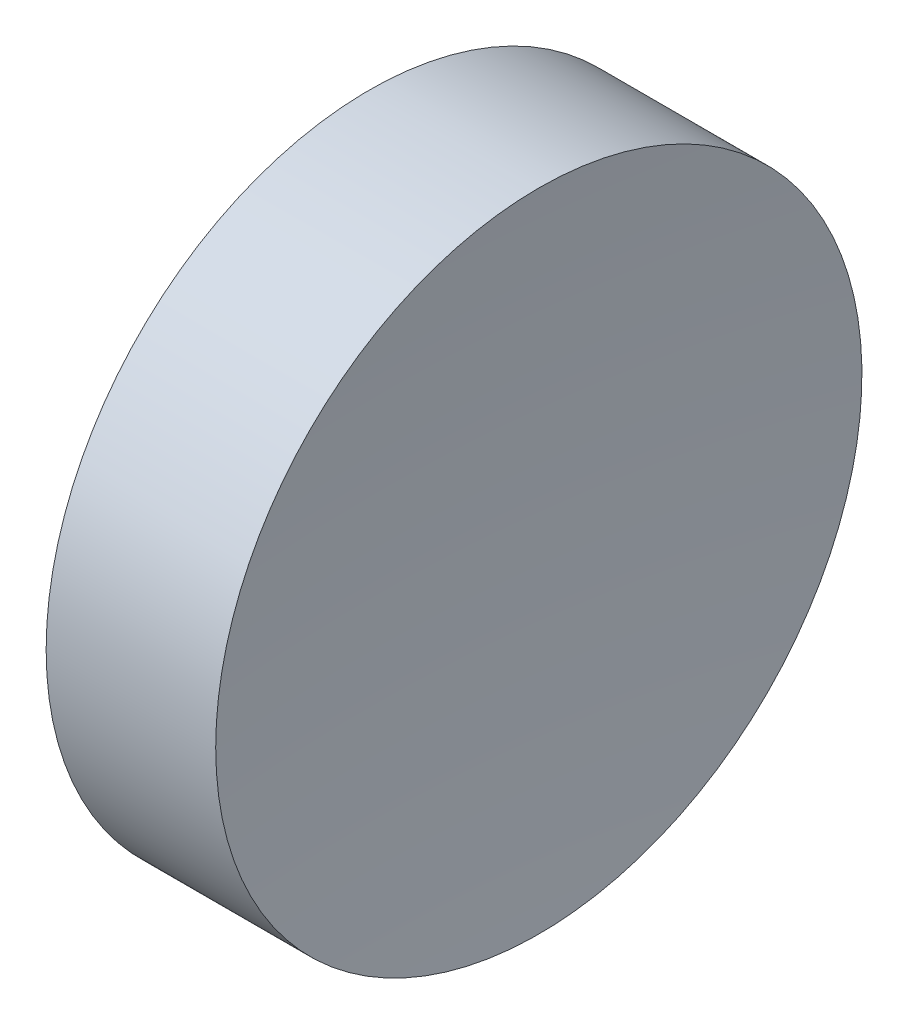
ISO-10303-21;
HEADER;
FILE_DESCRIPTION(('STEP AP214'),'2;1');
FILE_NAME('part.step','',(''),(''),'','','');
FILE_SCHEMA(('AUTOMOTIVE_DESIGN { 1 0 10303 214 1 1 1 1 }'));
ENDSEC;
DATA;
#1=APPLICATION_CONTEXT('core data for automotive mechanical design processes');
#2=APPLICATION_PROTOCOL_DEFINITION('international standard','automotive_design',2000,#1);
#3=PRODUCT_CONTEXT('',#1,'mechanical');
#4=PRODUCT('Part','Part','',(#3));
#5=PRODUCT_RELATED_PRODUCT_CATEGORY('part','',(#4));
#6=PRODUCT_DEFINITION_FORMATION('','',#4);
#7=PRODUCT_DEFINITION_CONTEXT('part definition',#1,'design');
#8=PRODUCT_DEFINITION('design','',#6,#7);
#9=PRODUCT_DEFINITION_SHAPE('','',#8);
#10=(LENGTH_UNIT() NAMED_UNIT(*) SI_UNIT(.MILLI.,.METRE.));
#11=(NAMED_UNIT(*) PLANE_ANGLE_UNIT() SI_UNIT($,.RADIAN.));
#12=(NAMED_UNIT(*) SI_UNIT($,.STERADIAN.) SOLID_ANGLE_UNIT());
#13=UNCERTAINTY_MEASURE_WITH_UNIT(LENGTH_MEASURE(1.E-05),#10,'distance_accuracy_value','');
#14=(GEOMETRIC_REPRESENTATION_CONTEXT(3) GLOBAL_UNCERTAINTY_ASSIGNED_CONTEXT((#13)) GLOBAL_UNIT_ASSIGNED_CONTEXT((#10,
#11,#12)) REPRESENTATION_CONTEXT('',''));
#15=CARTESIAN_POINT('',(0.,0.,0.));
#16=DIRECTION('',(0.,0.,1.));
#17=DIRECTION('',(1.,0.,0.));
#18=AXIS2_PLACEMENT_3D('',#15,#16,#17);
#19=CARTESIAN_POINT('',(130.54632776735,34.6890105616862,0.));
#20=DIRECTION('',(-1.,0.,0.));
#21=DIRECTION('',(0.,1.,0.));
#22=AXIS2_PLACEMENT_3D('',#19,#20,#21);
#23=SPHERICAL_SURFACE('',#22,70.);
#24=CARTESIAN_POINT('',(60.8259039304284,34.6890105616862,0.));
#25=DIRECTION('',(-1.,0.,0.));
#26=DIRECTION('',(0.,0.,1.));
#27=AXIS2_PLACEMENT_3D('',#24,#25,#26);
#28=CIRCLE('',#27,6.25000000000001);
#29=CARTESIAN_POINT('',(60.8259039304284,34.6890105616862,6.25000000000001));
#30=VERTEX_POINT('',#29);
#31=EDGE_CURVE('E10',#30,#30,#28,.T.);
#32=ORIENTED_EDGE('',*,*,#31,.F.);
#33=EDGE_LOOP('',(#32));
#34=FACE_BOUND('',#33,.T.);
#35=ADVANCED_FACE('F35',(#34),#23,.F.);
#36=CARTESIAN_POINT('',(54.4925715010826,34.6890105616862,0.));
#37=DIRECTION('',(-1.,0.,0.));
#38=DIRECTION('',(0.,0.,1.));
#39=AXIS2_PLACEMENT_3D('',#36,#37,#38);
#40=CYLINDRICAL_SURFACE('',#39,6.25);
#41=CARTESIAN_POINT('',(57.5463277674598,34.6890105616862,0.));
#42=DIRECTION('',(-1.,0.,0.));
#43=DIRECTION('',(0.,0.,1.));
#44=AXIS2_PLACEMENT_3D('',#41,#42,#43);
#45=CIRCLE('',#44,6.25);
#46=CARTESIAN_POINT('',(57.5463277674598,34.6890105616862,6.25));
#47=VERTEX_POINT('',#46);
#48=EDGE_CURVE('E41',#47,#47,#45,.T.);
#49=ORIENTED_EDGE('',*,*,#48,.F.);
#50=EDGE_LOOP('',(#49));
#51=FACE_BOUND('',#50,.T.);
#52=ORIENTED_EDGE('',*,*,#31,.T.);
#53=EDGE_LOOP('',(#52));
#54=FACE_BOUND('',#53,.T.);
#55=ADVANCED_FACE('F49',(#51,#54),#40,.T.);
#56=CARTESIAN_POINT('',(57.5463277674598,34.6890105616862,0.));
#57=DIRECTION('',(1.,0.,0.));
#58=DIRECTION('',(0.,0.,-1.));
#59=AXIS2_PLACEMENT_3D('',#56,#57,#58);
#60=PLANE('',#59);
#61=ORIENTED_EDGE('',*,*,#48,.T.);
#62=EDGE_LOOP('',(#61));
#63=FACE_BOUND('',#62,.T.);
#64=ADVANCED_FACE('F47',(#63),#60,.F.);
#65=CLOSED_SHELL('',(#35,#55,#64));
#66=MANIFOLD_SOLID_BREP('B2',#65);
#67=ADVANCED_BREP_SHAPE_REPRESENTATION('',(#18,#66),#14);
#68=SHAPE_DEFINITION_REPRESENTATION(#9,#67);
ENDSEC;
END-ISO-10303-21;
